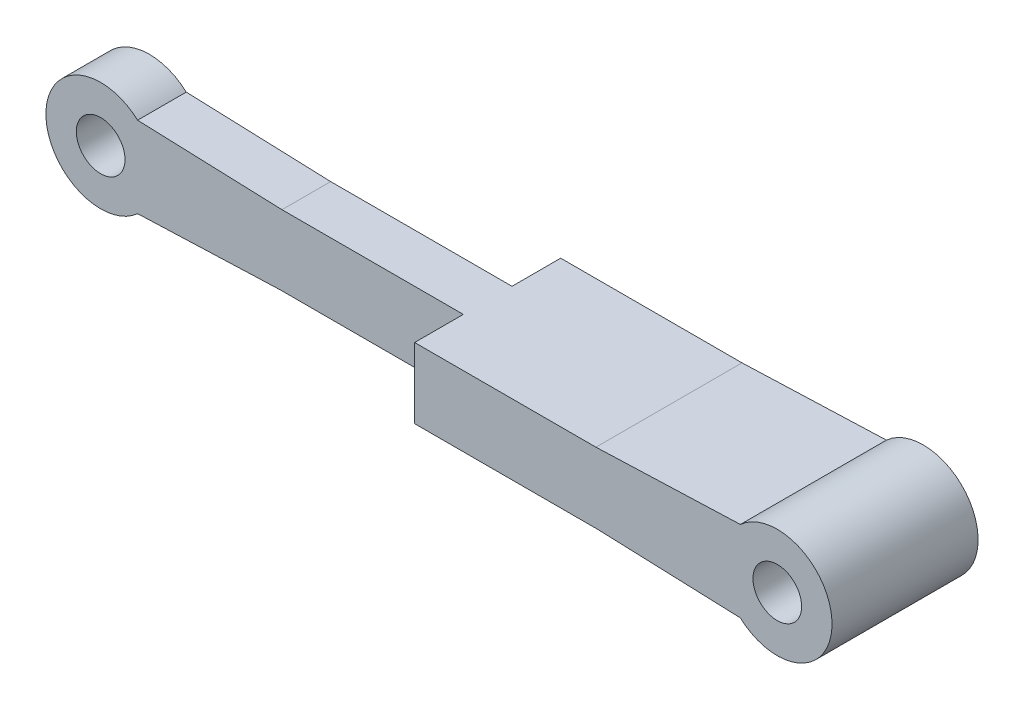
ISO-10303-21;
HEADER;
FILE_DESCRIPTION(('STEP AP214'),'2;1');
FILE_NAME('part.step','',(''),(''),'','','');
FILE_SCHEMA(('AUTOMOTIVE_DESIGN { 1 0 10303 214 1 1 1 1 }'));
ENDSEC;
DATA;
#1=APPLICATION_CONTEXT('core data for automotive mechanical design processes');
#2=APPLICATION_PROTOCOL_DEFINITION('international standard','automotive_design',2000,#1);
#3=PRODUCT_CONTEXT('',#1,'mechanical');
#4=PRODUCT('Part','Part','',(#3));
#5=PRODUCT_RELATED_PRODUCT_CATEGORY('part','',(#4));
#6=PRODUCT_DEFINITION_FORMATION('','',#4);
#7=PRODUCT_DEFINITION_CONTEXT('part definition',#1,'design');
#8=PRODUCT_DEFINITION('design','',#6,#7);
#9=PRODUCT_DEFINITION_SHAPE('','',#8);
#10=(LENGTH_UNIT() NAMED_UNIT(*) SI_UNIT(.MILLI.,.METRE.));
#11=(NAMED_UNIT(*) PLANE_ANGLE_UNIT() SI_UNIT($,.RADIAN.));
#12=(NAMED_UNIT(*) SI_UNIT($,.STERADIAN.) SOLID_ANGLE_UNIT());
#13=UNCERTAINTY_MEASURE_WITH_UNIT(LENGTH_MEASURE(1.E-05),#10,'distance_accuracy_value','');
#14=(GEOMETRIC_REPRESENTATION_CONTEXT(3) GLOBAL_UNCERTAINTY_ASSIGNED_CONTEXT((#13)) GLOBAL_UNIT_ASSIGNED_CONTEXT((#10,
#11,#12)) REPRESENTATION_CONTEXT('',''));
#15=CARTESIAN_POINT('',(0.,0.,0.));
#16=DIRECTION('',(0.,0.,1.));
#17=DIRECTION('',(1.,0.,0.));
#18=AXIS2_PLACEMENT_3D('',#15,#16,#17);
#19=CARTESIAN_POINT('',(-148.967401035,0.,60.));
#20=DIRECTION('',(0.,0.,-1.));
#21=DIRECTION('',(-1.,0.,0.));
#22=AXIS2_PLACEMENT_3D('',#19,#20,#21);
#23=CYLINDRICAL_SURFACE('',#22,22.5);
#24=CARTESIAN_POINT('',(-148.967401035,0.,40.));
#25=DIRECTION('',(0.,0.,1.));
#26=DIRECTION('',(1.,0.,0.));
#27=AXIS2_PLACEMENT_3D('',#24,#25,#26);
#28=CIRCLE('',#27,22.5);
#29=CARTESIAN_POINT('',(-133.805803377284,16.6245588352152,40.));
#30=VERTEX_POINT('',#29);
#31=CARTESIAN_POINT('',(-133.805803377284,-16.6245588352152,40.));
#32=VERTEX_POINT('',#31);
#33=EDGE_CURVE('E196',#30,#32,#28,.T.);
#34=ORIENTED_EDGE('',*,*,#33,.F.);
#35=DIRECTION('',(0.,0.,-1.));
#36=VECTOR('',#35,1.);
#37=CARTESIAN_POINT('',(-133.805803377284,16.6245588352152,60.));
#38=LINE('',#37,#36);
#39=CARTESIAN_POINT('',(-133.805803377284,16.6245588352152,20.));
#40=VERTEX_POINT('',#39);
#41=EDGE_CURVE('E219',#30,#40,#38,.T.);
#42=ORIENTED_EDGE('',*,*,#41,.T.);
#43=CARTESIAN_POINT('',(-148.967401035,0.,20.));
#44=DIRECTION('',(0.,0.,1.));
#45=DIRECTION('',(1.,0.,0.));
#46=AXIS2_PLACEMENT_3D('',#43,#44,#45);
#47=CIRCLE('',#46,22.5);
#48=CARTESIAN_POINT('',(-133.805803377284,-16.6245588352152,20.));
#49=VERTEX_POINT('',#48);
#50=EDGE_CURVE('E188',#40,#49,#47,.T.);
#51=ORIENTED_EDGE('',*,*,#50,.T.);
#52=DIRECTION('',(0.,0.,-1.));
#53=VECTOR('',#52,1.);
#54=CARTESIAN_POINT('',(-133.805803377284,-16.6245588352152,60.));
#55=LINE('',#54,#53);
#56=EDGE_CURVE('E250',#32,#49,#55,.T.);
#57=ORIENTED_EDGE('',*,*,#56,.F.);
#58=EDGE_LOOP('',(#34,#42,#51,#57));
#59=FACE_BOUND('',#58,.T.);
#60=ADVANCED_FACE('F72',(#59),#23,.T.);
#61=CARTESIAN_POINT('',(0.434401600523264,-11.595544441856,60.));
#62=DIRECTION('',(0.037436542130634,-0.99929900696103,0.));
#63=DIRECTION('',(0.99929900696103,0.037436542130634,0.));
#64=AXIS2_PLACEMENT_3D('',#61,#62,#63);
#65=PLANE('',#64);
#66=DIRECTION('',(0.,0.,-1.));
#67=VECTOR('',#66,1.);
#68=CARTESIAN_POINT('',(-75.2137233017879,-14.4295352647041,60.));
#69=LINE('',#68,#67);
#70=CARTESIAN_POINT('',(-75.2137233017879,-14.4295352647041,40.));
#71=VERTEX_POINT('',#70);
#72=CARTESIAN_POINT('',(-75.2137233017879,-14.4295352647041,20.));
#73=VERTEX_POINT('',#72);
#74=EDGE_CURVE('E183',#71,#73,#69,.T.);
#75=ORIENTED_EDGE('',*,*,#74,.F.);
#76=DIRECTION('',(-0.99929900696103,-0.037436542130634,0.));
#77=VECTOR('',#76,1.);
#78=CARTESIAN_POINT('',(0.434401600523262,-11.595544441856,40.));
#79=LINE('',#78,#77);
#80=EDGE_CURVE('E198',#71,#32,#79,.T.);
#81=ORIENTED_EDGE('',*,*,#80,.T.);
#82=ORIENTED_EDGE('',*,*,#56,.T.);
#83=DIRECTION('',(-0.99929900696103,-0.037436542130634,0.));
#84=VECTOR('',#83,1.);
#85=CARTESIAN_POINT('',(0.434401600523264,-11.595544441856,20.));
#86=LINE('',#85,#84);
#87=EDGE_CURVE('E184',#73,#49,#86,.T.);
#88=ORIENTED_EDGE('',*,*,#87,.F.);
#89=EDGE_LOOP('',(#75,#81,#82,#88));
#90=FACE_BOUND('',#89,.T.);
#91=ADVANCED_FACE('F270',(#90),#65,.T.);
#92=CARTESIAN_POINT('',(0.,-14.4295352647041,60.));
#93=DIRECTION('',(0.,1.,0.));
#94=DIRECTION('',(0.,0.,1.));
#95=AXIS2_PLACEMENT_3D('',#92,#93,#94);
#96=PLANE('',#95);
#97=DIRECTION('',(0.,0.,1.));
#98=VECTOR('',#97,1.);
#99=CARTESIAN_POINT('',(0.,-14.4295352647041,60.));
#100=LINE('',#99,#98);
#101=CARTESIAN_POINT('',(0.,-14.4295352647041,40.));
#102=VERTEX_POINT('',#101);
#103=CARTESIAN_POINT('',(0.,-14.4295352647041,60.));
#104=VERTEX_POINT('',#103);
#105=EDGE_CURVE('E89',#102,#104,#100,.T.);
#106=ORIENTED_EDGE('',*,*,#105,.F.);
#107=DIRECTION('',(1.,0.,0.));
#108=VECTOR('',#107,1.);
#109=CARTESIAN_POINT('',(0.,-14.4295352647041,40.));
#110=LINE('',#109,#108);
#111=EDGE_CURVE('E201',#71,#102,#110,.T.);
#112=ORIENTED_EDGE('',*,*,#111,.F.);
#113=ORIENTED_EDGE('',*,*,#74,.T.);
#114=DIRECTION('',(1.,0.,0.));
#115=VECTOR('',#114,1.);
#116=CARTESIAN_POINT('',(0.,-14.4295352647041,20.));
#117=LINE('',#116,#115);
#118=CARTESIAN_POINT('',(0.,-14.4295352647041,20.));
#119=VERTEX_POINT('',#118);
#120=EDGE_CURVE('E173',#73,#119,#117,.T.);
#121=ORIENTED_EDGE('',*,*,#120,.T.);
#122=DIRECTION('',(0.,0.,1.));
#123=VECTOR('',#122,1.);
#124=CARTESIAN_POINT('',(0.,-14.4295352647041,60.));
#125=LINE('',#124,#123);
#126=CARTESIAN_POINT('',(0.,-14.4295352647041,0.));
#127=VERTEX_POINT('',#126);
#128=EDGE_CURVE('E162',#127,#119,#125,.T.);
#129=ORIENTED_EDGE('',*,*,#128,.F.);
#130=DIRECTION('',(1.,0.,0.));
#131=VECTOR('',#130,1.);
#132=CARTESIAN_POINT('',(0.,-14.4295352647041,0.));
#133=LINE('',#132,#131);
#134=CARTESIAN_POINT('',(75.2137233017879,-14.4295352647041,0.));
#135=VERTEX_POINT('',#134);
#136=EDGE_CURVE('E203',#127,#135,#133,.T.);
#137=ORIENTED_EDGE('',*,*,#136,.T.);
#138=DIRECTION('',(0.,0.,-1.));
#139=VECTOR('',#138,1.);
#140=CARTESIAN_POINT('',(75.2137233017879,-14.4295352647041,60.));
#141=LINE('',#140,#139);
#142=CARTESIAN_POINT('',(75.2137233017879,-14.4295352647041,60.));
#143=VERTEX_POINT('',#142);
#144=EDGE_CURVE('E246',#143,#135,#141,.T.);
#145=ORIENTED_EDGE('',*,*,#144,.F.);
#146=DIRECTION('',(1.,0.,0.));
#147=VECTOR('',#146,1.);
#148=CARTESIAN_POINT('',(0.,-14.4295352647041,60.));
#149=LINE('',#148,#147);
#150=EDGE_CURVE('E204',#104,#143,#149,.T.);
#151=ORIENTED_EDGE('',*,*,#150,.F.);
#152=EDGE_LOOP('',(#106,#112,#113,#121,#129,#137,#145,#151));
#153=FACE_BOUND('',#152,.T.);
#154=ADVANCED_FACE('F180',(#153),#96,.F.);
#155=CARTESIAN_POINT('',(0.,14.4479902138989,60.));
#156=DIRECTION('',(0.,1.,0.));
#157=DIRECTION('',(0.,0.,1.));
#158=AXIS2_PLACEMENT_3D('',#155,#156,#157);
#159=PLANE('',#158);
#160=DIRECTION('',(1.,0.,0.));
#161=VECTOR('',#160,1.);
#162=CARTESIAN_POINT('',(0.,14.4479902138989,40.));
#163=LINE('',#162,#161);
#164=CARTESIAN_POINT('',(-74.4837005175,14.4479902138989,40.));
#165=VERTEX_POINT('',#164);
#166=CARTESIAN_POINT('',(0.,14.4479902138989,40.));
#167=VERTEX_POINT('',#166);
#168=EDGE_CURVE('E193',#165,#167,#163,.T.);
#169=ORIENTED_EDGE('',*,*,#168,.T.);
#170=DIRECTION('',(0.,0.,1.));
#171=VECTOR('',#170,1.);
#172=CARTESIAN_POINT('',(0.,14.4479902138989,60.));
#173=LINE('',#172,#171);
#174=CARTESIAN_POINT('',(0.,14.4479902138989,60.));
#175=VERTEX_POINT('',#174);
#176=EDGE_CURVE('E169',#167,#175,#173,.T.);
#177=ORIENTED_EDGE('',*,*,#176,.T.);
#178=DIRECTION('',(1.,0.,0.));
#179=VECTOR('',#178,1.);
#180=CARTESIAN_POINT('',(0.,14.4479902138989,60.));
#181=LINE('',#180,#179);
#182=CARTESIAN_POINT('',(74.4837005175,14.4479902138989,60.));
#183=VERTEX_POINT('',#182);
#184=EDGE_CURVE('E214',#175,#183,#181,.T.);
#185=ORIENTED_EDGE('',*,*,#184,.T.);
#186=DIRECTION('',(0.,0.,-1.));
#187=VECTOR('',#186,1.);
#188=CARTESIAN_POINT('',(74.4837005175,14.4479902138989,60.));
#189=LINE('',#188,#187);
#190=CARTESIAN_POINT('',(74.4837005175,14.4479902138989,0.));
#191=VERTEX_POINT('',#190);
#192=EDGE_CURVE('E237',#183,#191,#189,.T.);
#193=ORIENTED_EDGE('',*,*,#192,.T.);
#194=DIRECTION('',(1.,0.,0.));
#195=VECTOR('',#194,1.);
#196=CARTESIAN_POINT('',(0.,14.4479902138989,0.));
#197=LINE('',#196,#195);
#198=CARTESIAN_POINT('',(0.,14.4479902138989,0.));
#199=VERTEX_POINT('',#198);
#200=EDGE_CURVE('E228',#199,#191,#197,.T.);
#201=ORIENTED_EDGE('',*,*,#200,.F.);
#202=DIRECTION('',(0.,0.,1.));
#203=VECTOR('',#202,1.);
#204=CARTESIAN_POINT('',(0.,14.4479902138989,60.));
#205=LINE('',#204,#203);
#206=CARTESIAN_POINT('',(0.,14.4479902138989,20.));
#207=VERTEX_POINT('',#206);
#208=EDGE_CURVE('E96',#199,#207,#205,.T.);
#209=ORIENTED_EDGE('',*,*,#208,.T.);
#210=DIRECTION('',(1.,0.,0.));
#211=VECTOR('',#210,1.);
#212=CARTESIAN_POINT('',(0.,14.4479902138989,20.));
#213=LINE('',#212,#211);
#214=CARTESIAN_POINT('',(-74.4837005175,14.4479902138989,20.));
#215=VERTEX_POINT('',#214);
#216=EDGE_CURVE('E176',#215,#207,#213,.T.);
#217=ORIENTED_EDGE('',*,*,#216,.F.);
#218=DIRECTION('',(0.,0.,-1.));
#219=VECTOR('',#218,1.);
#220=CARTESIAN_POINT('',(-74.4837005175,14.4479902138989,60.));
#221=LINE('',#220,#219);
#222=EDGE_CURVE('E234',#165,#215,#221,.T.);
#223=ORIENTED_EDGE('',*,*,#222,.F.);
#224=EDGE_LOOP('',(#169,#177,#185,#193,#201,#209,#217,#223));
#225=FACE_BOUND('',#224,.T.);
#226=ADVANCED_FACE('F284',(#225),#159,.T.);
#227=CARTESIAN_POINT('',(0.429258360491721,11.6993823971937,60.));
#228=DIRECTION('',(-0.0366660138244022,-0.999327575637853,0.));
#229=DIRECTION('',(0.999327575637853,-0.0366660138244022,0.));
#230=AXIS2_PLACEMENT_3D('',#227,#228,#229);
#231=PLANE('',#230);
#232=DIRECTION('',(-0.999327575637853,0.0366660138244022,0.));
#233=VECTOR('',#232,1.);
#234=CARTESIAN_POINT('',(0.429258360491719,11.6993823971937,40.));
#235=LINE('',#234,#233);
#236=EDGE_CURVE('E187',#165,#30,#235,.T.);
#237=ORIENTED_EDGE('',*,*,#236,.F.);
#238=ORIENTED_EDGE('',*,*,#222,.T.);
#239=DIRECTION('',(-0.999327575637853,0.0366660138244022,0.));
#240=VECTOR('',#239,1.);
#241=CARTESIAN_POINT('',(0.429258360491721,11.6993823971937,20.));
#242=LINE('',#241,#240);
#243=EDGE_CURVE('E255',#215,#40,#242,.T.);
#244=ORIENTED_EDGE('',*,*,#243,.T.);
#245=ORIENTED_EDGE('',*,*,#41,.F.);
#246=EDGE_LOOP('',(#237,#238,#244,#245));
#247=FACE_BOUND('',#246,.T.);
#248=ADVANCED_FACE('F289',(#247),#231,.F.);
#249=CARTESIAN_POINT('',(0.,0.,60.));
#250=DIRECTION('',(0.,0.,1.));
#251=DIRECTION('',(1.,0.,0.));
#252=AXIS2_PLACEMENT_3D('',#249,#250,#251);
#253=PLANE('',#252);
#254=CARTESIAN_POINT('',(148.967401035,0.,60.));
#255=DIRECTION('',(0.,0.,1.));
#256=DIRECTION('',(1.,0.,0.));
#257=AXIS2_PLACEMENT_3D('',#254,#255,#256);
#258=CIRCLE('',#257,10.);
#259=CARTESIAN_POINT('',(158.967401035,0.,60.));
#260=VERTEX_POINT('',#259);
#261=EDGE_CURVE('E216',#260,#260,#258,.T.);
#262=ORIENTED_EDGE('',*,*,#261,.F.);
#263=EDGE_LOOP('',(#262));
#264=FACE_BOUND('',#263,.T.);
#265=ORIENTED_EDGE('',*,*,#184,.F.);
#266=DIRECTION('',(0.,-1.,0.));
#267=VECTOR('',#266,1.);
#268=CARTESIAN_POINT('',(0.,0.,60.));
#269=LINE('',#268,#267);
#270=EDGE_CURVE('E13',#175,#104,#269,.T.);
#271=ORIENTED_EDGE('',*,*,#270,.T.);
#272=ORIENTED_EDGE('',*,*,#150,.T.);
#273=DIRECTION('',(0.99929900696103,-0.0374365421306344,0.));
#274=VECTOR('',#273,1.);
#275=CARTESIAN_POINT('',(-0.434401600523267,-11.5955444418559,60.));
#276=LINE('',#275,#274);
#277=CARTESIAN_POINT('',(133.805803377284,-16.6245588352152,60.));
#278=VERTEX_POINT('',#277);
#279=EDGE_CURVE('E206',#143,#278,#276,.T.);
#280=ORIENTED_EDGE('',*,*,#279,.T.);
#281=CARTESIAN_POINT('',(148.967401035,0.,60.));
#282=DIRECTION('',(0.,0.,1.));
#283=DIRECTION('',(1.,0.,0.));
#284=AXIS2_PLACEMENT_3D('',#281,#282,#283);
#285=CIRCLE('',#284,22.5);
#286=CARTESIAN_POINT('',(133.805803377284,16.6245588352152,60.));
#287=VERTEX_POINT('',#286);
#288=EDGE_CURVE('E209',#278,#287,#285,.T.);
#289=ORIENTED_EDGE('',*,*,#288,.T.);
#290=DIRECTION('',(0.999327575637853,0.0366660138244022,0.));
#291=VECTOR('',#290,1.);
#292=CARTESIAN_POINT('',(-0.429258360491721,11.6993823971937,60.));
#293=LINE('',#292,#291);
#294=EDGE_CURVE('E211',#183,#287,#293,.T.);
#295=ORIENTED_EDGE('',*,*,#294,.F.);
#296=EDGE_LOOP('',(#265,#271,#272,#280,#289,#295));
#297=FACE_BOUND('',#296,.T.);
#298=ADVANCED_FACE('F279',(#264,#297),#253,.T.);
#299=CARTESIAN_POINT('',(0.,0.,0.));
#300=DIRECTION('',(0.,0.,1.));
#301=DIRECTION('',(1.,0.,0.));
#302=AXIS2_PLACEMENT_3D('',#299,#300,#301);
#303=PLANE('',#302);
#304=CARTESIAN_POINT('',(148.967401035,0.,0.));
#305=DIRECTION('',(0.,0.,1.));
#306=DIRECTION('',(1.,0.,0.));
#307=AXIS2_PLACEMENT_3D('',#304,#305,#306);
#308=CIRCLE('',#307,10.);
#309=CARTESIAN_POINT('',(158.967401035,0.,0.));
#310=VERTEX_POINT('',#309);
#311=EDGE_CURVE('E207',#310,#310,#308,.T.);
#312=ORIENTED_EDGE('',*,*,#311,.T.);
#313=EDGE_LOOP('',(#312));
#314=FACE_BOUND('',#313,.T.);
#315=DIRECTION('',(0.,-1.,0.));
#316=VECTOR('',#315,1.);
#317=CARTESIAN_POINT('',(0.,0.,0.));
#318=LINE('',#317,#316);
#319=EDGE_CURVE('E81',#199,#127,#318,.T.);
#320=ORIENTED_EDGE('',*,*,#319,.F.);
#321=ORIENTED_EDGE('',*,*,#200,.T.);
#322=DIRECTION('',(0.999327575637853,0.0366660138244022,0.));
#323=VECTOR('',#322,1.);
#324=CARTESIAN_POINT('',(-0.429258360491721,11.6993823971937,0.));
#325=LINE('',#324,#323);
#326=CARTESIAN_POINT('',(133.805803377284,16.6245588352152,0.));
#327=VERTEX_POINT('',#326);
#328=EDGE_CURVE('E225',#191,#327,#325,.T.);
#329=ORIENTED_EDGE('',*,*,#328,.T.);
#330=CARTESIAN_POINT('',(148.967401035,0.,0.));
#331=DIRECTION('',(0.,0.,1.));
#332=DIRECTION('',(1.,0.,0.));
#333=AXIS2_PLACEMENT_3D('',#330,#331,#332);
#334=CIRCLE('',#333,22.5);
#335=CARTESIAN_POINT('',(133.805803377284,-16.6245588352152,0.));
#336=VERTEX_POINT('',#335);
#337=EDGE_CURVE('E223',#336,#327,#334,.T.);
#338=ORIENTED_EDGE('',*,*,#337,.F.);
#339=DIRECTION('',(0.99929900696103,-0.0374365421306344,0.));
#340=VECTOR('',#339,1.);
#341=CARTESIAN_POINT('',(-0.434401600523267,-11.5955444418559,0.));
#342=LINE('',#341,#340);
#343=EDGE_CURVE('E221',#135,#336,#342,.T.);
#344=ORIENTED_EDGE('',*,*,#343,.F.);
#345=ORIENTED_EDGE('',*,*,#136,.F.);
#346=EDGE_LOOP('',(#320,#321,#329,#338,#344,#345));
#347=FACE_BOUND('',#346,.T.);
#348=ADVANCED_FACE('F295',(#314,#347),#303,.F.);
#349=CARTESIAN_POINT('',(-0.434401600523267,-11.5955444418559,60.));
#350=DIRECTION('',(0.0374365421306344,0.99929900696103,0.));
#351=DIRECTION('',(-0.99929900696103,0.0374365421306344,0.));
#352=AXIS2_PLACEMENT_3D('',#349,#350,#351);
#353=PLANE('',#352);
#354=ORIENTED_EDGE('',*,*,#343,.T.);
#355=DIRECTION('',(0.,0.,-1.));
#356=VECTOR('',#355,1.);
#357=CARTESIAN_POINT('',(133.805803377284,-16.6245588352152,60.));
#358=LINE('',#357,#356);
#359=EDGE_CURVE('E243',#278,#336,#358,.T.);
#360=ORIENTED_EDGE('',*,*,#359,.F.);
#361=ORIENTED_EDGE('',*,*,#279,.F.);
#362=ORIENTED_EDGE('',*,*,#144,.T.);
#363=EDGE_LOOP('',(#354,#360,#361,#362));
#364=FACE_BOUND('',#363,.T.);
#365=ADVANCED_FACE('F299',(#364),#353,.F.);
#366=CARTESIAN_POINT('',(148.967401035,0.,60.));
#367=DIRECTION('',(0.,0.,-1.));
#368=DIRECTION('',(-1.,0.,0.));
#369=AXIS2_PLACEMENT_3D('',#366,#367,#368);
#370=CYLINDRICAL_SURFACE('',#369,22.5);
#371=DIRECTION('',(0.,0.,-1.));
#372=VECTOR('',#371,1.);
#373=CARTESIAN_POINT('',(133.805803377284,16.6245588352152,60.));
#374=LINE('',#373,#372);
#375=EDGE_CURVE('E240',#287,#327,#374,.T.);
#376=ORIENTED_EDGE('',*,*,#375,.F.);
#377=ORIENTED_EDGE('',*,*,#288,.F.);
#378=ORIENTED_EDGE('',*,*,#359,.T.);
#379=ORIENTED_EDGE('',*,*,#337,.T.);
#380=EDGE_LOOP('',(#376,#377,#378,#379));
#381=FACE_BOUND('',#380,.T.);
#382=ADVANCED_FACE('F303',(#381),#370,.T.);
#383=CARTESIAN_POINT('',(-0.429258360491721,11.6993823971937,60.));
#384=DIRECTION('',(-0.0366660138244022,0.999327575637853,0.));
#385=DIRECTION('',(-0.999327575637853,-0.0366660138244022,0.));
#386=AXIS2_PLACEMENT_3D('',#383,#384,#385);
#387=PLANE('',#386);
#388=ORIENTED_EDGE('',*,*,#328,.F.);
#389=ORIENTED_EDGE('',*,*,#192,.F.);
#390=ORIENTED_EDGE('',*,*,#294,.T.);
#391=ORIENTED_EDGE('',*,*,#375,.T.);
#392=EDGE_LOOP('',(#388,#389,#390,#391));
#393=FACE_BOUND('',#392,.T.);
#394=ADVANCED_FACE('F305',(#393),#387,.T.);
#395=CARTESIAN_POINT('',(148.967401035,0.,60.));
#396=DIRECTION('',(0.,0.,-1.));
#397=DIRECTION('',(-1.,0.,0.));
#398=AXIS2_PLACEMENT_3D('',#395,#396,#397);
#399=CYLINDRICAL_SURFACE('',#398,10.);
#400=ORIENTED_EDGE('',*,*,#261,.T.);
#401=EDGE_LOOP('',(#400));
#402=FACE_BOUND('',#401,.T.);
#403=ORIENTED_EDGE('',*,*,#311,.F.);
#404=EDGE_LOOP('',(#403));
#405=FACE_BOUND('',#404,.T.);
#406=ADVANCED_FACE('F307',(#402,#405),#399,.F.);
#407=CARTESIAN_POINT('',(0.,-45.5520097861011,0.));
#408=DIRECTION('',(-1.,0.,0.));
#409=DIRECTION('',(0.,0.,1.));
#410=AXIS2_PLACEMENT_3D('',#407,#408,#409);
#411=PLANE('',#410);
#412=ORIENTED_EDGE('',*,*,#128,.T.);
#413=DIRECTION('',(0.,1.,0.));
#414=VECTOR('',#413,1.);
#415=CARTESIAN_POINT('',(0.,-45.5520097861011,20.));
#416=LINE('',#415,#414);
#417=EDGE_CURVE('E165',#119,#207,#416,.T.);
#418=ORIENTED_EDGE('',*,*,#417,.T.);
#419=ORIENTED_EDGE('',*,*,#208,.F.);
#420=ORIENTED_EDGE('',*,*,#319,.T.);
#421=EDGE_LOOP('',(#412,#418,#419,#420));
#422=FACE_BOUND('',#421,.T.);
#423=ADVANCED_FACE('F164',(#422),#411,.T.);
#424=CARTESIAN_POINT('',(0.,-45.5520097861011,20.));
#425=DIRECTION('',(0.,0.,1.));
#426=DIRECTION('',(1.,0.,0.));
#427=AXIS2_PLACEMENT_3D('',#424,#425,#426);
#428=PLANE('',#427);
#429=CARTESIAN_POINT('',(-148.967401035,0.,20.));
#430=DIRECTION('',(0.,0.,1.));
#431=DIRECTION('',(1.,0.,0.));
#432=AXIS2_PLACEMENT_3D('',#429,#430,#431);
#433=CIRCLE('',#432,10.);
#434=CARTESIAN_POINT('',(-138.967401035,0.,20.));
#435=VERTEX_POINT('',#434);
#436=EDGE_CURVE('E253',#435,#435,#433,.T.);
#437=ORIENTED_EDGE('',*,*,#436,.T.);
#438=EDGE_LOOP('',(#437));
#439=FACE_BOUND('',#438,.T.);
#440=ORIENTED_EDGE('',*,*,#87,.T.);
#441=ORIENTED_EDGE('',*,*,#50,.F.);
#442=ORIENTED_EDGE('',*,*,#243,.F.);
#443=ORIENTED_EDGE('',*,*,#216,.T.);
#444=ORIENTED_EDGE('',*,*,#417,.F.);
#445=ORIENTED_EDGE('',*,*,#120,.F.);
#446=EDGE_LOOP('',(#440,#441,#442,#443,#444,#445));
#447=FACE_BOUND('',#446,.T.);
#448=ADVANCED_FACE('F172',(#439,#447),#428,.F.);
#449=CARTESIAN_POINT('',(0.,-45.5520097861011,40.));
#450=DIRECTION('',(0.,0.,1.));
#451=DIRECTION('',(1.,0.,0.));
#452=AXIS2_PLACEMENT_3D('',#449,#450,#451);
#453=PLANE('',#452);
#454=CARTESIAN_POINT('',(-148.967401035,0.,40.));
#455=DIRECTION('',(0.,0.,1.));
#456=DIRECTION('',(1.,0.,0.));
#457=AXIS2_PLACEMENT_3D('',#454,#455,#456);
#458=CIRCLE('',#457,10.);
#459=CARTESIAN_POINT('',(-138.967401035,0.,40.));
#460=VERTEX_POINT('',#459);
#461=EDGE_CURVE('E76',#460,#460,#458,.T.);
#462=ORIENTED_EDGE('',*,*,#461,.F.);
#463=EDGE_LOOP('',(#462));
#464=FACE_BOUND('',#463,.T.);
#465=ORIENTED_EDGE('',*,*,#111,.T.);
#466=DIRECTION('',(0.,1.,0.));
#467=VECTOR('',#466,1.);
#468=CARTESIAN_POINT('',(0.,-45.5520097861011,40.));
#469=LINE('',#468,#467);
#470=EDGE_CURVE('E177',#102,#167,#469,.T.);
#471=ORIENTED_EDGE('',*,*,#470,.T.);
#472=ORIENTED_EDGE('',*,*,#168,.F.);
#473=ORIENTED_EDGE('',*,*,#236,.T.);
#474=ORIENTED_EDGE('',*,*,#33,.T.);
#475=ORIENTED_EDGE('',*,*,#80,.F.);
#476=EDGE_LOOP('',(#465,#471,#472,#473,#474,#475));
#477=FACE_BOUND('',#476,.T.);
#478=ADVANCED_FACE('F272',(#464,#477),#453,.T.);
#479=ORIENTED_EDGE('',*,*,#105,.T.);
#480=ORIENTED_EDGE('',*,*,#270,.F.);
#481=ORIENTED_EDGE('',*,*,#176,.F.);
#482=ORIENTED_EDGE('',*,*,#470,.F.);
#483=EDGE_LOOP('',(#479,#480,#481,#482));
#484=FACE_BOUND('',#483,.T.);
#485=ADVANCED_FACE('F282',(#484),#411,.T.);
#486=CARTESIAN_POINT('',(-148.967401035,0.,60.));
#487=DIRECTION('',(0.,0.,-1.));
#488=DIRECTION('',(-1.,0.,0.));
#489=AXIS2_PLACEMENT_3D('',#486,#487,#488);
#490=CYLINDRICAL_SURFACE('',#489,10.);
#491=ORIENTED_EDGE('',*,*,#436,.F.);
#492=EDGE_LOOP('',(#491));
#493=FACE_BOUND('',#492,.T.);
#494=ORIENTED_EDGE('',*,*,#461,.T.);
#495=EDGE_LOOP('',(#494));
#496=FACE_BOUND('',#495,.T.);
#497=ADVANCED_FACE('F74',(#493,#496),#490,.F.);
#498=CLOSED_SHELL('',(#60,#91,#154,#226,#248,#298,#348,#365,#382,#394,#406,#423,#448,#478,#485,#497));
#499=MANIFOLD_SOLID_BREP('B2',#498);
#500=ADVANCED_BREP_SHAPE_REPRESENTATION('',(#18,#499),#14);
#501=SHAPE_DEFINITION_REPRESENTATION(#9,#500);
ENDSEC;
END-ISO-10303-21;
